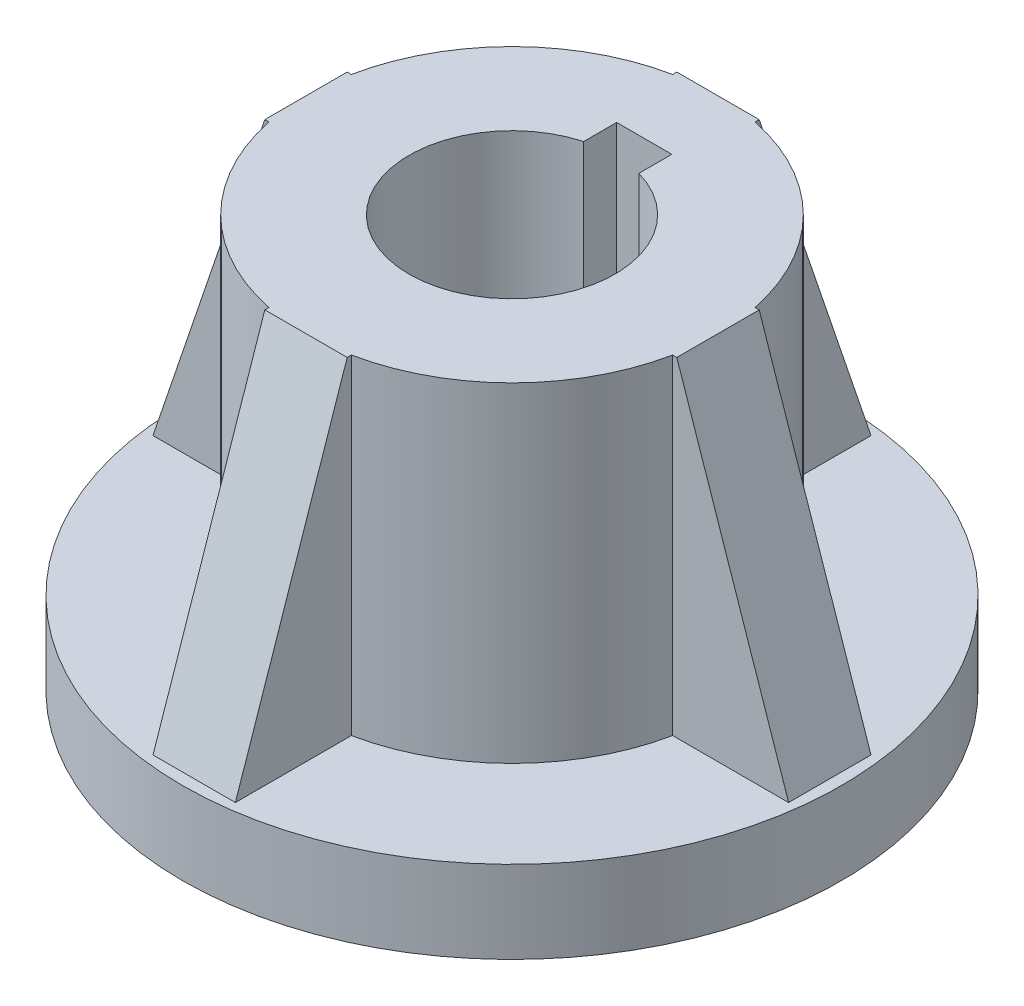
ISO-10303-21;
HEADER;
FILE_DESCRIPTION(('STEP AP214'),'2;1');
FILE_NAME('part.step','',(''),(''),'','','');
FILE_SCHEMA(('AUTOMOTIVE_DESIGN { 1 0 10303 214 1 1 1 1 }'));
ENDSEC;
DATA;
#1=APPLICATION_CONTEXT('core data for automotive mechanical design processes');
#2=APPLICATION_PROTOCOL_DEFINITION('international standard','automotive_design',2000,#1);
#3=PRODUCT_CONTEXT('',#1,'mechanical');
#4=PRODUCT('Part','Part','',(#3));
#5=PRODUCT_RELATED_PRODUCT_CATEGORY('part','',(#4));
#6=PRODUCT_DEFINITION_FORMATION('','',#4);
#7=PRODUCT_DEFINITION_CONTEXT('part definition',#1,'design');
#8=PRODUCT_DEFINITION('design','',#6,#7);
#9=PRODUCT_DEFINITION_SHAPE('','',#8);
#10=(LENGTH_UNIT() NAMED_UNIT(*) SI_UNIT(.MILLI.,.METRE.));
#11=(NAMED_UNIT(*) PLANE_ANGLE_UNIT() SI_UNIT($,.RADIAN.));
#12=(NAMED_UNIT(*) SI_UNIT($,.STERADIAN.) SOLID_ANGLE_UNIT());
#13=UNCERTAINTY_MEASURE_WITH_UNIT(LENGTH_MEASURE(1.E-05),#10,'distance_accuracy_value','');
#14=(GEOMETRIC_REPRESENTATION_CONTEXT(3) GLOBAL_UNCERTAINTY_ASSIGNED_CONTEXT((#13)) GLOBAL_UNIT_ASSIGNED_CONTEXT((#10,
#11,#12)) REPRESENTATION_CONTEXT('',''));
#15=CARTESIAN_POINT('',(0.,0.,0.));
#16=DIRECTION('',(0.,0.,1.));
#17=DIRECTION('',(1.,0.,0.));
#18=AXIS2_PLACEMENT_3D('',#15,#16,#17);
#19=CARTESIAN_POINT('',(0.,50.,0.));
#20=DIRECTION('',(0.,-1.,0.));
#21=DIRECTION('',(0.,0.,-1.));
#22=AXIS2_PLACEMENT_3D('',#19,#20,#21);
#23=CYLINDRICAL_SURFACE('',#22,25.);
#24=DIRECTION('',(0.,-1.,0.));
#25=VECTOR('',#24,1.);
#26=CARTESIAN_POINT('',(-24.4948974278318,50.,-4.99999999999974));
#27=LINE('',#26,#25);
#28=CARTESIAN_POINT('',(-24.4948974278318,50.,-4.99999999999974));
#29=VERTEX_POINT('',#28);
#30=CARTESIAN_POINT('',(-24.4948974278318,10.,-4.99999999999974));
#31=VERTEX_POINT('',#30);
#32=EDGE_CURVE('E198',#29,#31,#27,.T.);
#33=ORIENTED_EDGE('',*,*,#32,.F.);
#34=CARTESIAN_POINT('',(0.,50.,0.));
#35=DIRECTION('',(0.,1.,0.));
#36=DIRECTION('',(0.,0.,1.));
#37=AXIS2_PLACEMENT_3D('',#34,#35,#36);
#38=CIRCLE('',#37,25.);
#39=CARTESIAN_POINT('',(-5.,50.,-24.4948974278318));
#40=VERTEX_POINT('',#39);
#41=EDGE_CURVE('E644',#40,#29,#38,.T.);
#42=ORIENTED_EDGE('',*,*,#41,.F.);
#43=DIRECTION('',(0.,-1.,0.));
#44=VECTOR('',#43,1.);
#45=CARTESIAN_POINT('',(-5.,50.,-24.4948974278318));
#46=LINE('',#45,#44);
#47=CARTESIAN_POINT('',(-5.,10.,-24.4948974278318));
#48=VERTEX_POINT('',#47);
#49=EDGE_CURVE('E220',#40,#48,#46,.T.);
#50=ORIENTED_EDGE('',*,*,#49,.T.);
#51=CARTESIAN_POINT('',(0.,10.,0.));
#52=DIRECTION('',(0.,1.,0.));
#53=DIRECTION('',(0.,0.,1.));
#54=AXIS2_PLACEMENT_3D('',#51,#52,#53);
#55=CIRCLE('',#54,25.);
#56=EDGE_CURVE('E318',#48,#31,#55,.T.);
#57=ORIENTED_EDGE('',*,*,#56,.T.);
#58=EDGE_LOOP('',(#33,#42,#50,#57));
#59=FACE_BOUND('',#58,.T.);
#60=ADVANCED_FACE('F37',(#59),#23,.T.);
#61=DIRECTION('',(0.,-1.,0.));
#62=VECTOR('',#61,1.);
#63=CARTESIAN_POINT('',(5.,50.,-24.4948974278318));
#64=LINE('',#63,#62);
#65=CARTESIAN_POINT('',(5.,50.,-24.4948974278318));
#66=VERTEX_POINT('',#65);
#67=CARTESIAN_POINT('',(5.,10.,-24.4948974278318));
#68=VERTEX_POINT('',#67);
#69=EDGE_CURVE('E223',#66,#68,#64,.T.);
#70=ORIENTED_EDGE('',*,*,#69,.F.);
#71=CARTESIAN_POINT('',(24.4948974278318,50.,-5.00000000000009));
#72=VERTEX_POINT('',#71);
#73=EDGE_CURVE('E314',#72,#66,#38,.T.);
#74=ORIENTED_EDGE('',*,*,#73,.F.);
#75=DIRECTION('',(0.,-1.,0.));
#76=VECTOR('',#75,1.);
#77=CARTESIAN_POINT('',(24.4948974278318,50.,-5.00000000000009));
#78=LINE('',#77,#76);
#79=CARTESIAN_POINT('',(24.4948974278318,10.,-5.00000000000009));
#80=VERTEX_POINT('',#79);
#81=EDGE_CURVE('E248',#72,#80,#78,.T.);
#82=ORIENTED_EDGE('',*,*,#81,.T.);
#83=EDGE_CURVE('E46',#80,#68,#55,.T.);
#84=ORIENTED_EDGE('',*,*,#83,.T.);
#85=EDGE_LOOP('',(#70,#74,#82,#84));
#86=FACE_BOUND('',#85,.T.);
#87=ADVANCED_FACE('F337',(#86),#23,.T.);
#88=DIRECTION('',(0.,-1.,0.));
#89=VECTOR('',#88,1.);
#90=CARTESIAN_POINT('',(24.4948974278318,50.,4.99999999999991));
#91=LINE('',#90,#89);
#92=CARTESIAN_POINT('',(24.4948974278318,50.,4.99999999999991));
#93=VERTEX_POINT('',#92);
#94=CARTESIAN_POINT('',(24.4948974278318,10.,4.99999999999991));
#95=VERTEX_POINT('',#94);
#96=EDGE_CURVE('E244',#93,#95,#91,.T.);
#97=ORIENTED_EDGE('',*,*,#96,.F.);
#98=CARTESIAN_POINT('',(5.,50.,24.4948974278318));
#99=VERTEX_POINT('',#98);
#100=EDGE_CURVE('E312',#99,#93,#38,.T.);
#101=ORIENTED_EDGE('',*,*,#100,.F.);
#102=DIRECTION('',(0.,-1.,0.));
#103=VECTOR('',#102,1.);
#104=CARTESIAN_POINT('',(5.,50.,24.4948974278318));
#105=LINE('',#104,#103);
#106=CARTESIAN_POINT('',(5.,10.,24.4948974278318));
#107=VERTEX_POINT('',#106);
#108=EDGE_CURVE('E273',#99,#107,#105,.T.);
#109=ORIENTED_EDGE('',*,*,#108,.T.);
#110=EDGE_CURVE('E11',#107,#95,#55,.T.);
#111=ORIENTED_EDGE('',*,*,#110,.T.);
#112=EDGE_LOOP('',(#97,#101,#109,#111));
#113=FACE_BOUND('',#112,.T.);
#114=ADVANCED_FACE('F334',(#113),#23,.T.);
#115=CARTESIAN_POINT('',(0.,10.,0.));
#116=DIRECTION('',(0.,-1.,0.));
#117=DIRECTION('',(0.,0.,-1.));
#118=AXIS2_PLACEMENT_3D('',#115,#116,#117);
#119=CYLINDRICAL_SURFACE('',#118,40.);
#120=CARTESIAN_POINT('',(0.,0.,0.));
#121=DIRECTION('',(0.,1.,0.));
#122=DIRECTION('',(0.,0.,1.));
#123=AXIS2_PLACEMENT_3D('',#120,#121,#122);
#124=CIRCLE('',#123,40.);
#125=CARTESIAN_POINT('',(0.,0.,40.));
#126=VERTEX_POINT('',#125);
#127=EDGE_CURVE('E41',#126,#126,#124,.T.);
#128=ORIENTED_EDGE('',*,*,#127,.T.);
#129=EDGE_LOOP('',(#128));
#130=FACE_BOUND('',#129,.T.);
#131=CARTESIAN_POINT('',(0.,10.,0.));
#132=DIRECTION('',(0.,1.,0.));
#133=DIRECTION('',(0.,0.,1.));
#134=AXIS2_PLACEMENT_3D('',#131,#132,#133);
#135=CIRCLE('',#134,40.);
#136=CARTESIAN_POINT('',(0.,10.,40.));
#137=VERTEX_POINT('',#136);
#138=EDGE_CURVE('E315',#137,#137,#135,.T.);
#139=ORIENTED_EDGE('',*,*,#138,.F.);
#140=EDGE_LOOP('',(#139));
#141=FACE_BOUND('',#140,.T.);
#142=ADVANCED_FACE('F39',(#130,#141),#119,.T.);
#143=CARTESIAN_POINT('',(0.,10.,0.));
#144=DIRECTION('',(0.,1.,0.));
#145=DIRECTION('',(0.,0.,1.));
#146=AXIS2_PLACEMENT_3D('',#143,#144,#145);
#147=PLANE('',#146);
#148=DIRECTION('',(1.,0.,0.));
#149=VECTOR('',#148,1.);
#150=CARTESIAN_POINT('',(0.,10.,5.));
#151=LINE('',#150,#149);
#152=CARTESIAN_POINT('',(-38.5736690223326,10.,5.0000000000004));
#153=VERTEX_POINT('',#152);
#154=CARTESIAN_POINT('',(-24.4948974278317,10.,5.00000000000026));
#155=VERTEX_POINT('',#154);
#156=EDGE_CURVE('E191',#153,#155,#151,.T.);
#157=ORIENTED_EDGE('',*,*,#156,.F.);
#158=DIRECTION('',(0.,0.,1.));
#159=VECTOR('',#158,1.);
#160=CARTESIAN_POINT('',(-38.5736690223327,10.,4.04037736686558E-13));
#161=LINE('',#160,#159);
#162=CARTESIAN_POINT('',(-38.5736690223327,10.,-4.9999999999996));
#163=VERTEX_POINT('',#162);
#164=EDGE_CURVE('E178',#163,#153,#161,.T.);
#165=ORIENTED_EDGE('',*,*,#164,.F.);
#166=DIRECTION('',(1.,0.,0.));
#167=VECTOR('',#166,1.);
#168=CARTESIAN_POINT('',(0.,10.,-5.));
#169=LINE('',#168,#167);
#170=EDGE_CURVE('E201',#163,#31,#169,.T.);
#171=ORIENTED_EDGE('',*,*,#170,.T.);
#172=ORIENTED_EDGE('',*,*,#56,.F.);
#173=DIRECTION('',(0.,0.,1.));
#174=VECTOR('',#173,1.);
#175=CARTESIAN_POINT('',(-5.,10.,0.));
#176=LINE('',#175,#174);
#177=CARTESIAN_POINT('',(-5.,10.,-38.5736690223327));
#178=VERTEX_POINT('',#177);
#179=EDGE_CURVE('E221',#178,#48,#176,.T.);
#180=ORIENTED_EDGE('',*,*,#179,.F.);
#181=DIRECTION('',(-1.,0.,0.));
#182=VECTOR('',#181,1.);
#183=CARTESIAN_POINT('',(0.,10.,-38.5736690223327));
#184=LINE('',#183,#182);
#185=CARTESIAN_POINT('',(5.,10.,-38.5736690223327));
#186=VERTEX_POINT('',#185);
#187=EDGE_CURVE('E211',#186,#178,#184,.T.);
#188=ORIENTED_EDGE('',*,*,#187,.F.);
#189=DIRECTION('',(0.,0.,1.));
#190=VECTOR('',#189,1.);
#191=CARTESIAN_POINT('',(5.,10.,0.));
#192=LINE('',#191,#190);
#193=EDGE_CURVE('E226',#186,#68,#192,.T.);
#194=ORIENTED_EDGE('',*,*,#193,.T.);
#195=ORIENTED_EDGE('',*,*,#83,.F.);
#196=DIRECTION('',(-1.,0.,0.));
#197=VECTOR('',#196,1.);
#198=CARTESIAN_POINT('',(0.,10.,-5.));
#199=LINE('',#198,#197);
#200=CARTESIAN_POINT('',(38.5736690223327,10.,-5.00000000000013));
#201=VERTEX_POINT('',#200);
#202=EDGE_CURVE('E250',#201,#80,#199,.T.);
#203=ORIENTED_EDGE('',*,*,#202,.F.);
#204=DIRECTION('',(0.,0.,-1.));
#205=VECTOR('',#204,1.);
#206=CARTESIAN_POINT('',(38.5736690223327,10.,-1.34679245562186E-13));
#207=LINE('',#206,#205);
#208=CARTESIAN_POINT('',(38.5736690223327,10.,4.99999999999987));
#209=VERTEX_POINT('',#208);
#210=EDGE_CURVE('E234',#209,#201,#207,.T.);
#211=ORIENTED_EDGE('',*,*,#210,.F.);
#212=DIRECTION('',(-1.,0.,0.));
#213=VECTOR('',#212,1.);
#214=CARTESIAN_POINT('',(0.,10.,5.));
#215=LINE('',#214,#213);
#216=EDGE_CURVE('E245',#209,#95,#215,.T.);
#217=ORIENTED_EDGE('',*,*,#216,.T.);
#218=ORIENTED_EDGE('',*,*,#110,.F.);
#219=DIRECTION('',(0.,0.,-1.));
#220=VECTOR('',#219,1.);
#221=CARTESIAN_POINT('',(5.,10.,0.));
#222=LINE('',#221,#220);
#223=CARTESIAN_POINT('',(5.,10.,38.5736690223327));
#224=VERTEX_POINT('',#223);
#225=EDGE_CURVE('E276',#224,#107,#222,.T.);
#226=ORIENTED_EDGE('',*,*,#225,.F.);
#227=DIRECTION('',(1.,0.,0.));
#228=VECTOR('',#227,1.);
#229=CARTESIAN_POINT('',(0.,10.,38.5736690223327));
#230=LINE('',#229,#228);
#231=CARTESIAN_POINT('',(-5.,10.,38.5736690223327));
#232=VERTEX_POINT('',#231);
#233=EDGE_CURVE('E258',#232,#224,#230,.T.);
#234=ORIENTED_EDGE('',*,*,#233,.F.);
#235=DIRECTION('',(0.,0.,-1.));
#236=VECTOR('',#235,1.);
#237=CARTESIAN_POINT('',(-5.,10.,0.));
#238=LINE('',#237,#236);
#239=CARTESIAN_POINT('',(-5.,10.,24.4948974278318));
#240=VERTEX_POINT('',#239);
#241=EDGE_CURVE('E271',#232,#240,#238,.T.);
#242=ORIENTED_EDGE('',*,*,#241,.T.);
#243=EDGE_CURVE('E48',#155,#240,#55,.T.);
#244=ORIENTED_EDGE('',*,*,#243,.F.);
#245=EDGE_LOOP('',(#157,#165,#171,#172,#180,#188,#194,#195,#203,#211,#217,#218,#226,#234,#242,#244));
#246=FACE_BOUND('',#245,.T.);
#247=ORIENTED_EDGE('',*,*,#138,.T.);
#248=EDGE_LOOP('',(#247));
#249=FACE_BOUND('',#248,.T.);
#250=ADVANCED_FACE('F195',(#246,#249),#147,.T.);
#251=CARTESIAN_POINT('',(0.,0.,0.));
#252=DIRECTION('',(0.,1.,0.));
#253=DIRECTION('',(0.,0.,1.));
#254=AXIS2_PLACEMENT_3D('',#251,#252,#253);
#255=PLANE('',#254);
#256=ORIENTED_EDGE('',*,*,#127,.F.);
#257=EDGE_LOOP('',(#256));
#258=FACE_BOUND('',#257,.T.);
#259=ADVANCED_FACE('F324',(#258),#255,.F.);
#260=CARTESIAN_POINT('',(-24.4948974278317,50.,5.00000000000026));
#261=VERTEX_POINT('',#260);
#262=CARTESIAN_POINT('',(-5.,50.,24.4948974278318));
#263=VERTEX_POINT('',#262);
#264=EDGE_CURVE('E305',#261,#263,#38,.T.);
#265=ORIENTED_EDGE('',*,*,#264,.F.);
#266=DIRECTION('',(0.,-1.,0.));
#267=VECTOR('',#266,1.);
#268=CARTESIAN_POINT('',(-24.4948974278317,50.,5.00000000000026));
#269=LINE('',#268,#267);
#270=EDGE_CURVE('E199',#261,#155,#269,.T.);
#271=ORIENTED_EDGE('',*,*,#270,.T.);
#272=ORIENTED_EDGE('',*,*,#243,.T.);
#273=DIRECTION('',(0.,-1.,0.));
#274=VECTOR('',#273,1.);
#275=CARTESIAN_POINT('',(-5.,50.,24.4948974278318));
#276=LINE('',#275,#274);
#277=EDGE_CURVE('E270',#263,#240,#276,.T.);
#278=ORIENTED_EDGE('',*,*,#277,.F.);
#279=EDGE_LOOP('',(#265,#271,#272,#278));
#280=FACE_BOUND('',#279,.T.);
#281=ADVANCED_FACE('F326',(#280),#23,.T.);
#282=CARTESIAN_POINT('',(0.,50.,0.));
#283=DIRECTION('',(0.,1.,0.));
#284=DIRECTION('',(0.,0.,1.));
#285=AXIS2_PLACEMENT_3D('',#282,#283,#284);
#286=PLANE('',#285);
#287=DIRECTION('',(0.,0.,-1.));
#288=VECTOR('',#287,1.);
#289=CARTESIAN_POINT('',(3.34966148102332,50.,-16.0501237429907));
#290=LINE('',#289,#288);
#291=CARTESIAN_POINT('',(3.34966148102332,50.,-12.0428305627269));
#292=VERTEX_POINT('',#291);
#293=CARTESIAN_POINT('',(3.34966148102332,50.,-16.0501237429907));
#294=VERTEX_POINT('',#293);
#295=EDGE_CURVE('E295',#292,#294,#290,.T.);
#296=ORIENTED_EDGE('',*,*,#295,.F.);
#297=CARTESIAN_POINT('',(0.,50.,0.));
#298=DIRECTION('',(0.,1.,0.));
#299=DIRECTION('',(0.,0.,1.));
#300=AXIS2_PLACEMENT_3D('',#297,#298,#299);
#301=CIRCLE('',#300,12.5);
#302=CARTESIAN_POINT('',(-3.34966148102332,50.,-12.0428305627269));
#303=VERTEX_POINT('',#302);
#304=EDGE_CURVE('E278',#303,#292,#301,.T.);
#305=ORIENTED_EDGE('',*,*,#304,.F.);
#306=DIRECTION('',(0.,0.,1.));
#307=VECTOR('',#306,1.);
#308=CARTESIAN_POINT('',(-3.34966148102332,50.,-12.0428305627269));
#309=LINE('',#308,#307);
#310=CARTESIAN_POINT('',(-3.34966148102332,50.,-16.0501237429907));
#311=VERTEX_POINT('',#310);
#312=EDGE_CURVE('E284',#311,#303,#309,.T.);
#313=ORIENTED_EDGE('',*,*,#312,.F.);
#314=DIRECTION('',(-1.,0.,0.));
#315=VECTOR('',#314,1.);
#316=CARTESIAN_POINT('',(-3.34966148102332,50.,-16.0501237429907));
#317=LINE('',#316,#315);
#318=EDGE_CURVE('E298',#294,#311,#317,.T.);
#319=ORIENTED_EDGE('',*,*,#318,.F.);
#320=EDGE_LOOP('',(#296,#305,#313,#319));
#321=FACE_BOUND('',#320,.T.);
#322=ORIENTED_EDGE('',*,*,#41,.T.);
#323=DIRECTION('',(1.,0.,0.));
#324=VECTOR('',#323,1.);
#325=CARTESIAN_POINT('',(0.,50.,-5.));
#326=LINE('',#325,#324);
#327=CARTESIAN_POINT('',(-25.0000000000001,50.,-4.99999999999974));
#328=VERTEX_POINT('',#327);
#329=EDGE_CURVE('E649',#328,#29,#326,.T.);
#330=ORIENTED_EDGE('',*,*,#329,.F.);
#331=DIRECTION('',(0.,0.,1.));
#332=VECTOR('',#331,1.);
#333=CARTESIAN_POINT('',(-25.,50.,2.61861100413235E-13));
#334=LINE('',#333,#332);
#335=CARTESIAN_POINT('',(-25.,50.,5.00000000000026));
#336=VERTEX_POINT('',#335);
#337=EDGE_CURVE('E187',#328,#336,#334,.T.);
#338=ORIENTED_EDGE('',*,*,#337,.T.);
#339=DIRECTION('',(1.,0.,0.));
#340=VECTOR('',#339,1.);
#341=CARTESIAN_POINT('',(0.,50.,5.));
#342=LINE('',#341,#340);
#343=EDGE_CURVE('E55',#336,#261,#342,.T.);
#344=ORIENTED_EDGE('',*,*,#343,.T.);
#345=ORIENTED_EDGE('',*,*,#264,.T.);
#346=DIRECTION('',(0.,0.,-1.));
#347=VECTOR('',#346,1.);
#348=CARTESIAN_POINT('',(-5.,50.,0.));
#349=LINE('',#348,#347);
#350=CARTESIAN_POINT('',(-5.,50.,25.));
#351=VERTEX_POINT('',#350);
#352=EDGE_CURVE('E252',#351,#263,#349,.T.);
#353=ORIENTED_EDGE('',*,*,#352,.F.);
#354=DIRECTION('',(1.,0.,0.));
#355=VECTOR('',#354,1.);
#356=CARTESIAN_POINT('',(0.,50.,25.));
#357=LINE('',#356,#355);
#358=CARTESIAN_POINT('',(5.,50.,25.));
#359=VERTEX_POINT('',#358);
#360=EDGE_CURVE('E268',#351,#359,#357,.T.);
#361=ORIENTED_EDGE('',*,*,#360,.T.);
#362=DIRECTION('',(0.,0.,-1.));
#363=VECTOR('',#362,1.);
#364=CARTESIAN_POINT('',(5.,50.,0.));
#365=LINE('',#364,#363);
#366=EDGE_CURVE('E259',#359,#99,#365,.T.);
#367=ORIENTED_EDGE('',*,*,#366,.T.);
#368=ORIENTED_EDGE('',*,*,#100,.T.);
#369=DIRECTION('',(-1.,0.,0.));
#370=VECTOR('',#369,1.);
#371=CARTESIAN_POINT('',(0.,50.,5.));
#372=LINE('',#371,#370);
#373=CARTESIAN_POINT('',(25.,50.,4.99999999999991));
#374=VERTEX_POINT('',#373);
#375=EDGE_CURVE('E229',#374,#93,#372,.T.);
#376=ORIENTED_EDGE('',*,*,#375,.F.);
#377=DIRECTION('',(0.,0.,-1.));
#378=VECTOR('',#377,1.);
#379=CARTESIAN_POINT('',(25.,50.,0.));
#380=LINE('',#379,#378);
#381=CARTESIAN_POINT('',(25.,50.,-5.00000000000009));
#382=VERTEX_POINT('',#381);
#383=EDGE_CURVE('E242',#374,#382,#380,.T.);
#384=ORIENTED_EDGE('',*,*,#383,.T.);
#385=DIRECTION('',(-1.,0.,0.));
#386=VECTOR('',#385,1.);
#387=CARTESIAN_POINT('',(0.,50.,-5.));
#388=LINE('',#387,#386);
#389=EDGE_CURVE('E235',#382,#72,#388,.T.);
#390=ORIENTED_EDGE('',*,*,#389,.T.);
#391=ORIENTED_EDGE('',*,*,#73,.T.);
#392=DIRECTION('',(0.,0.,1.));
#393=VECTOR('',#392,1.);
#394=CARTESIAN_POINT('',(5.,50.,0.));
#395=LINE('',#394,#393);
#396=CARTESIAN_POINT('',(5.,50.,-25.));
#397=VERTEX_POINT('',#396);
#398=EDGE_CURVE('E206',#397,#66,#395,.T.);
#399=ORIENTED_EDGE('',*,*,#398,.F.);
#400=DIRECTION('',(-1.,0.,0.));
#401=VECTOR('',#400,1.);
#402=CARTESIAN_POINT('',(0.,50.,-25.));
#403=LINE('',#402,#401);
#404=CARTESIAN_POINT('',(-5.,50.,-25.));
#405=VERTEX_POINT('',#404);
#406=EDGE_CURVE('E218',#397,#405,#403,.T.);
#407=ORIENTED_EDGE('',*,*,#406,.T.);
#408=DIRECTION('',(0.,0.,1.));
#409=VECTOR('',#408,1.);
#410=CARTESIAN_POINT('',(-5.,50.,0.));
#411=LINE('',#410,#409);
#412=EDGE_CURVE('E62',#405,#40,#411,.T.);
#413=ORIENTED_EDGE('',*,*,#412,.T.);
#414=EDGE_LOOP('',(#322,#330,#338,#344,#345,#353,#361,#367,#368,#376,#384,#390,#391,#399,#407,#413));
#415=FACE_BOUND('',#414,.T.);
#416=ADVANCED_FACE('F331',(#321,#415),#286,.T.);
#417=CARTESIAN_POINT('',(0.,10.,0.));
#418=DIRECTION('',(0.,1.,0.));
#419=DIRECTION('',(0.,0.,1.));
#420=AXIS2_PLACEMENT_3D('',#417,#418,#419);
#421=CYLINDRICAL_SURFACE('',#420,12.5);
#422=ORIENTED_EDGE('',*,*,#304,.T.);
#423=DIRECTION('',(0.,1.,0.));
#424=VECTOR('',#423,1.);
#425=CARTESIAN_POINT('',(3.34966148102332,10.,-12.0428305627269));
#426=LINE('',#425,#424);
#427=CARTESIAN_POINT('',(3.34966148102332,10.,-12.0428305627269));
#428=VERTEX_POINT('',#427);
#429=EDGE_CURVE('E293',#428,#292,#426,.T.);
#430=ORIENTED_EDGE('',*,*,#429,.F.);
#431=CARTESIAN_POINT('',(0.,10.,0.));
#432=DIRECTION('',(0.,1.,0.));
#433=DIRECTION('',(0.,0.,1.));
#434=AXIS2_PLACEMENT_3D('',#431,#432,#433);
#435=CIRCLE('',#434,12.5);
#436=CARTESIAN_POINT('',(-3.34966148102332,10.,-12.0428305627269));
#437=VERTEX_POINT('',#436);
#438=EDGE_CURVE('E281',#437,#428,#435,.T.);
#439=ORIENTED_EDGE('',*,*,#438,.F.);
#440=DIRECTION('',(0.,1.,0.));
#441=VECTOR('',#440,1.);
#442=CARTESIAN_POINT('',(-3.34966148102332,10.,-12.0428305627269));
#443=LINE('',#442,#441);
#444=EDGE_CURVE('E303',#437,#303,#443,.T.);
#445=ORIENTED_EDGE('',*,*,#444,.T.);
#446=EDGE_LOOP('',(#422,#430,#439,#445));
#447=FACE_BOUND('',#446,.T.);
#448=ADVANCED_FACE('F348',(#447),#421,.F.);
#449=CARTESIAN_POINT('',(-3.34966148102332,10.,-12.0428305627269));
#450=DIRECTION('',(-1.,0.,0.));
#451=DIRECTION('',(0.,0.,1.));
#452=AXIS2_PLACEMENT_3D('',#449,#450,#451);
#453=PLANE('',#452);
#454=ORIENTED_EDGE('',*,*,#312,.T.);
#455=ORIENTED_EDGE('',*,*,#444,.F.);
#456=DIRECTION('',(0.,0.,1.));
#457=VECTOR('',#456,1.);
#458=CARTESIAN_POINT('',(-3.34966148102332,10.,-12.0428305627269));
#459=LINE('',#458,#457);
#460=CARTESIAN_POINT('',(-3.34966148102332,10.,-16.0501237429907));
#461=VERTEX_POINT('',#460);
#462=EDGE_CURVE('E290',#461,#437,#459,.T.);
#463=ORIENTED_EDGE('',*,*,#462,.F.);
#464=DIRECTION('',(0.,1.,0.));
#465=VECTOR('',#464,1.);
#466=CARTESIAN_POINT('',(-3.34966148102332,10.,-16.0501237429907));
#467=LINE('',#466,#465);
#468=EDGE_CURVE('E306',#461,#311,#467,.T.);
#469=ORIENTED_EDGE('',*,*,#468,.T.);
#470=EDGE_LOOP('',(#454,#455,#463,#469));
#471=FACE_BOUND('',#470,.T.);
#472=ADVANCED_FACE('F352',(#471),#453,.F.);
#473=CARTESIAN_POINT('',(-3.34966148102332,10.,-16.0501237429907));
#474=DIRECTION('',(0.,0.,-1.));
#475=DIRECTION('',(-1.,0.,0.));
#476=AXIS2_PLACEMENT_3D('',#473,#474,#475);
#477=PLANE('',#476);
#478=ORIENTED_EDGE('',*,*,#318,.T.);
#479=ORIENTED_EDGE('',*,*,#468,.F.);
#480=DIRECTION('',(-1.,0.,0.));
#481=VECTOR('',#480,1.);
#482=CARTESIAN_POINT('',(-3.34966148102332,10.,-16.0501237429907));
#483=LINE('',#482,#481);
#484=CARTESIAN_POINT('',(3.34966148102332,10.,-16.0501237429907));
#485=VERTEX_POINT('',#484);
#486=EDGE_CURVE('E287',#485,#461,#483,.T.);
#487=ORIENTED_EDGE('',*,*,#486,.F.);
#488=DIRECTION('',(0.,1.,0.));
#489=VECTOR('',#488,1.);
#490=CARTESIAN_POINT('',(3.34966148102332,10.,-16.0501237429907));
#491=LINE('',#490,#489);
#492=EDGE_CURVE('E308',#485,#294,#491,.T.);
#493=ORIENTED_EDGE('',*,*,#492,.T.);
#494=EDGE_LOOP('',(#478,#479,#487,#493));
#495=FACE_BOUND('',#494,.T.);
#496=ADVANCED_FACE('F358',(#495),#477,.F.);
#497=CARTESIAN_POINT('',(3.34966148102332,10.,-16.0501237429907));
#498=DIRECTION('',(1.,0.,0.));
#499=DIRECTION('',(0.,0.,-1.));
#500=AXIS2_PLACEMENT_3D('',#497,#498,#499);
#501=PLANE('',#500);
#502=ORIENTED_EDGE('',*,*,#295,.T.);
#503=ORIENTED_EDGE('',*,*,#492,.F.);
#504=DIRECTION('',(0.,0.,-1.));
#505=VECTOR('',#504,1.);
#506=CARTESIAN_POINT('',(3.34966148102332,10.,-16.0501237429907));
#507=LINE('',#506,#505);
#508=EDGE_CURVE('E283',#428,#485,#507,.T.);
#509=ORIENTED_EDGE('',*,*,#508,.F.);
#510=ORIENTED_EDGE('',*,*,#429,.T.);
#511=EDGE_LOOP('',(#502,#503,#509,#510));
#512=FACE_BOUND('',#511,.T.);
#513=ADVANCED_FACE('F354',(#512),#501,.F.);
#514=CARTESIAN_POINT('',(0.,10.,0.));
#515=DIRECTION('',(0.,1.,0.));
#516=DIRECTION('',(0.,0.,1.));
#517=AXIS2_PLACEMENT_3D('',#514,#515,#516);
#518=PLANE('',#517);
#519=ORIENTED_EDGE('',*,*,#438,.T.);
#520=ORIENTED_EDGE('',*,*,#508,.T.);
#521=ORIENTED_EDGE('',*,*,#486,.T.);
#522=ORIENTED_EDGE('',*,*,#462,.T.);
#523=EDGE_LOOP('',(#519,#520,#521,#522));
#524=FACE_BOUND('',#523,.T.);
#525=ADVANCED_FACE('F357',(#524),#518,.T.);
#526=CARTESIAN_POINT('',(0.,50.,25.));
#527=DIRECTION('',(0.,-0.321343909472593,-0.946962560952053));
#528=DIRECTION('',(0.,0.946962560952053,-0.321343909472593));
#529=AXIS2_PLACEMENT_3D('',#526,#527,#528);
#530=PLANE('',#529);
#531=ORIENTED_EDGE('',*,*,#360,.F.);
#532=DIRECTION('',(0.,0.946962560952053,-0.321343909472593));
#533=VECTOR('',#532,1.);
#534=CARTESIAN_POINT('',(-5.,50.,25.));
#535=LINE('',#534,#533);
#536=EDGE_CURVE('E262',#232,#351,#535,.T.);
#537=ORIENTED_EDGE('',*,*,#536,.F.);
#538=ORIENTED_EDGE('',*,*,#233,.T.);
#539=DIRECTION('',(0.,0.946962560952053,-0.321343909472593));
#540=VECTOR('',#539,1.);
#541=CARTESIAN_POINT('',(5.,50.,25.));
#542=LINE('',#541,#540);
#543=EDGE_CURVE('E255',#224,#359,#542,.T.);
#544=ORIENTED_EDGE('',*,*,#543,.T.);
#545=EDGE_LOOP('',(#531,#537,#538,#544));
#546=FACE_BOUND('',#545,.T.);
#547=ADVANCED_FACE('F368',(#546),#530,.F.);
#548=CARTESIAN_POINT('',(5.,25.,0.));
#549=DIRECTION('',(1.,0.,0.));
#550=DIRECTION('',(0.,0.,-1.));
#551=AXIS2_PLACEMENT_3D('',#548,#549,#550);
#552=PLANE('',#551);
#553=ORIENTED_EDGE('',*,*,#543,.F.);
#554=ORIENTED_EDGE('',*,*,#225,.T.);
#555=ORIENTED_EDGE('',*,*,#108,.F.);
#556=ORIENTED_EDGE('',*,*,#366,.F.);
#557=EDGE_LOOP('',(#553,#554,#555,#556));
#558=FACE_BOUND('',#557,.T.);
#559=ADVANCED_FACE('F372',(#558),#552,.T.);
#560=CARTESIAN_POINT('',(-5.,25.,0.));
#561=DIRECTION('',(1.,0.,0.));
#562=DIRECTION('',(0.,0.,-1.));
#563=AXIS2_PLACEMENT_3D('',#560,#561,#562);
#564=PLANE('',#563);
#565=ORIENTED_EDGE('',*,*,#241,.F.);
#566=ORIENTED_EDGE('',*,*,#536,.T.);
#567=ORIENTED_EDGE('',*,*,#352,.T.);
#568=ORIENTED_EDGE('',*,*,#277,.T.);
#569=EDGE_LOOP('',(#565,#566,#567,#568));
#570=FACE_BOUND('',#569,.T.);
#571=ADVANCED_FACE('F374',(#570),#564,.F.);
#572=CARTESIAN_POINT('',(25.,50.,0.));
#573=DIRECTION('',(-0.946962560952053,-0.321343909472593,0.));
#574=DIRECTION('',(-0.321343909472593,0.946962560952053,0.));
#575=AXIS2_PLACEMENT_3D('',#572,#573,#574);
#576=PLANE('',#575);
#577=ORIENTED_EDGE('',*,*,#383,.F.);
#578=DIRECTION('',(-0.321343909472593,0.946962560952053,0.));
#579=VECTOR('',#578,1.);
#580=CARTESIAN_POINT('',(25.,50.,4.99999999999991));
#581=LINE('',#580,#579);
#582=EDGE_CURVE('E237',#209,#374,#581,.T.);
#583=ORIENTED_EDGE('',*,*,#582,.F.);
#584=ORIENTED_EDGE('',*,*,#210,.T.);
#585=DIRECTION('',(-0.321343909472593,0.946962560952053,0.));
#586=VECTOR('',#585,1.);
#587=CARTESIAN_POINT('',(25.,50.,-5.00000000000009));
#588=LINE('',#587,#586);
#589=EDGE_CURVE('E231',#201,#382,#588,.T.);
#590=ORIENTED_EDGE('',*,*,#589,.T.);
#591=EDGE_LOOP('',(#577,#583,#584,#590));
#592=FACE_BOUND('',#591,.T.);
#593=ADVANCED_FACE('F377',(#592),#576,.F.);
#594=CARTESIAN_POINT('',(0.,25.,-5.));
#595=DIRECTION('',(0.,0.,-1.));
#596=DIRECTION('',(-1.,0.,0.));
#597=AXIS2_PLACEMENT_3D('',#594,#595,#596);
#598=PLANE('',#597);
#599=ORIENTED_EDGE('',*,*,#589,.F.);
#600=ORIENTED_EDGE('',*,*,#202,.T.);
#601=ORIENTED_EDGE('',*,*,#81,.F.);
#602=ORIENTED_EDGE('',*,*,#389,.F.);
#603=EDGE_LOOP('',(#599,#600,#601,#602));
#604=FACE_BOUND('',#603,.T.);
#605=ADVANCED_FACE('F384',(#604),#598,.T.);
#606=CARTESIAN_POINT('',(0.,25.,5.));
#607=DIRECTION('',(0.,0.,-1.));
#608=DIRECTION('',(-1.,0.,0.));
#609=AXIS2_PLACEMENT_3D('',#606,#607,#608);
#610=PLANE('',#609);
#611=ORIENTED_EDGE('',*,*,#216,.F.);
#612=ORIENTED_EDGE('',*,*,#582,.T.);
#613=ORIENTED_EDGE('',*,*,#375,.T.);
#614=ORIENTED_EDGE('',*,*,#96,.T.);
#615=EDGE_LOOP('',(#611,#612,#613,#614));
#616=FACE_BOUND('',#615,.T.);
#617=ADVANCED_FACE('F386',(#616),#610,.F.);
#618=CARTESIAN_POINT('',(5.,25.,0.));
#619=DIRECTION('',(-1.,0.,0.));
#620=DIRECTION('',(0.,0.,1.));
#621=AXIS2_PLACEMENT_3D('',#618,#619,#620);
#622=PLANE('',#621);
#623=ORIENTED_EDGE('',*,*,#193,.F.);
#624=DIRECTION('',(0.,0.946962560952053,0.321343909472593));
#625=VECTOR('',#624,1.);
#626=CARTESIAN_POINT('',(5.,50.,-25.));
#627=LINE('',#626,#625);
#628=EDGE_CURVE('E213',#186,#397,#627,.T.);
#629=ORIENTED_EDGE('',*,*,#628,.T.);
#630=ORIENTED_EDGE('',*,*,#398,.T.);
#631=ORIENTED_EDGE('',*,*,#69,.T.);
#632=EDGE_LOOP('',(#623,#629,#630,#631));
#633=FACE_BOUND('',#632,.T.);
#634=ADVANCED_FACE('F389',(#633),#622,.F.);
#635=CARTESIAN_POINT('',(0.,50.,-25.));
#636=DIRECTION('',(0.,-0.321343909472593,0.946962560952053));
#637=DIRECTION('',(0.,0.946962560952053,0.321343909472593));
#638=AXIS2_PLACEMENT_3D('',#635,#636,#637);
#639=PLANE('',#638);
#640=ORIENTED_EDGE('',*,*,#406,.F.);
#641=ORIENTED_EDGE('',*,*,#628,.F.);
#642=ORIENTED_EDGE('',*,*,#187,.T.);
#643=DIRECTION('',(0.,0.946962560952053,0.321343909472593));
#644=VECTOR('',#643,1.);
#645=CARTESIAN_POINT('',(-5.,50.,-25.));
#646=LINE('',#645,#644);
#647=EDGE_CURVE('E208',#178,#405,#646,.T.);
#648=ORIENTED_EDGE('',*,*,#647,.T.);
#649=EDGE_LOOP('',(#640,#641,#642,#648));
#650=FACE_BOUND('',#649,.T.);
#651=ADVANCED_FACE('F394',(#650),#639,.F.);
#652=CARTESIAN_POINT('',(-5.,25.,0.));
#653=DIRECTION('',(-1.,0.,0.));
#654=DIRECTION('',(0.,0.,1.));
#655=AXIS2_PLACEMENT_3D('',#652,#653,#654);
#656=PLANE('',#655);
#657=ORIENTED_EDGE('',*,*,#647,.F.);
#658=ORIENTED_EDGE('',*,*,#179,.T.);
#659=ORIENTED_EDGE('',*,*,#49,.F.);
#660=ORIENTED_EDGE('',*,*,#412,.F.);
#661=EDGE_LOOP('',(#657,#658,#659,#660));
#662=FACE_BOUND('',#661,.T.);
#663=ADVANCED_FACE('F397',(#662),#656,.T.);
#664=CARTESIAN_POINT('',(0.,25.,-5.));
#665=DIRECTION('',(0.,0.,1.));
#666=DIRECTION('',(1.,0.,0.));
#667=AXIS2_PLACEMENT_3D('',#664,#665,#666);
#668=PLANE('',#667);
#669=ORIENTED_EDGE('',*,*,#170,.F.);
#670=DIRECTION('',(0.321343909472593,0.946962560952053,0.));
#671=VECTOR('',#670,1.);
#672=CARTESIAN_POINT('',(-25.0000000000001,50.,-4.99999999999974));
#673=LINE('',#672,#671);
#674=EDGE_CURVE('E183',#163,#328,#673,.T.);
#675=ORIENTED_EDGE('',*,*,#674,.T.);
#676=ORIENTED_EDGE('',*,*,#329,.T.);
#677=ORIENTED_EDGE('',*,*,#32,.T.);
#678=EDGE_LOOP('',(#669,#675,#676,#677));
#679=FACE_BOUND('',#678,.T.);
#680=ADVANCED_FACE('F404',(#679),#668,.F.);
#681=CARTESIAN_POINT('',(-25.,50.,2.61861100413235E-13));
#682=DIRECTION('',(0.946962560952053,-0.321343909472593,0.));
#683=DIRECTION('',(0.321343909472593,0.946962560952053,0.));
#684=AXIS2_PLACEMENT_3D('',#681,#682,#683);
#685=PLANE('',#684);
#686=ORIENTED_EDGE('',*,*,#337,.F.);
#687=ORIENTED_EDGE('',*,*,#674,.F.);
#688=ORIENTED_EDGE('',*,*,#164,.T.);
#689=DIRECTION('',(0.321343909472593,0.946962560952053,0.));
#690=VECTOR('',#689,1.);
#691=CARTESIAN_POINT('',(-25.,50.,5.00000000000026));
#692=LINE('',#691,#690);
#693=EDGE_CURVE('E181',#153,#336,#692,.T.);
#694=ORIENTED_EDGE('',*,*,#693,.T.);
#695=EDGE_LOOP('',(#686,#687,#688,#694));
#696=FACE_BOUND('',#695,.T.);
#697=ADVANCED_FACE('F180',(#696),#685,.F.);
#698=CARTESIAN_POINT('',(0.,25.,5.));
#699=DIRECTION('',(0.,0.,1.));
#700=DIRECTION('',(1.,0.,0.));
#701=AXIS2_PLACEMENT_3D('',#698,#699,#700);
#702=PLANE('',#701);
#703=ORIENTED_EDGE('',*,*,#693,.F.);
#704=ORIENTED_EDGE('',*,*,#156,.T.);
#705=ORIENTED_EDGE('',*,*,#270,.F.);
#706=ORIENTED_EDGE('',*,*,#343,.F.);
#707=EDGE_LOOP('',(#703,#704,#705,#706));
#708=FACE_BOUND('',#707,.T.);
#709=ADVANCED_FACE('F190',(#708),#702,.T.);
#710=CLOSED_SHELL('',(#60,#87,#114,#142,#250,#259,#281,#416,#448,#472,#496,#513,#525,#547,#559,
#571,#593,#605,#617,#634,#651,#663,#680,#697,#709));
#711=MANIFOLD_SOLID_BREP('B2',#710);
#712=ADVANCED_BREP_SHAPE_REPRESENTATION('',(#18,#711),#14);
#713=SHAPE_DEFINITION_REPRESENTATION(#9,#712);
ENDSEC;
END-ISO-10303-21;
